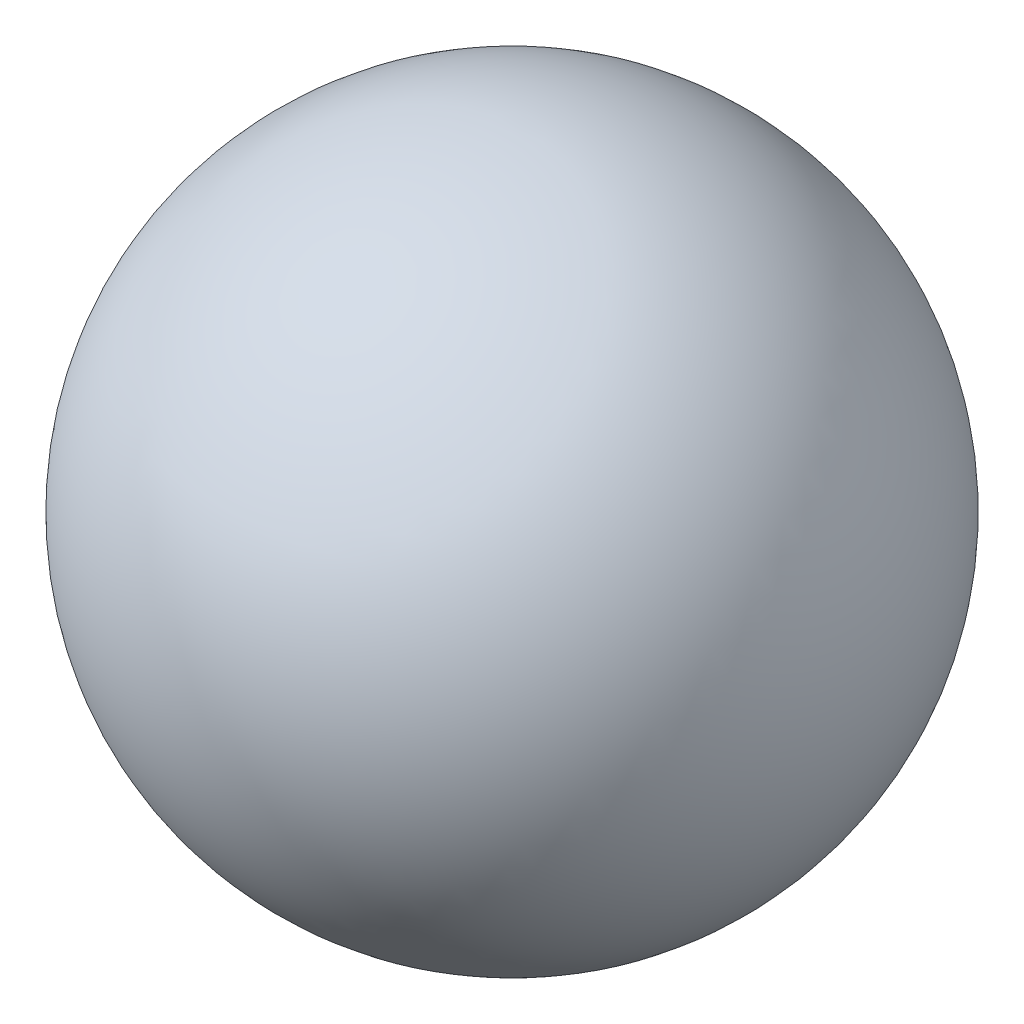
ISO-10303-21;
HEADER;
FILE_DESCRIPTION(('STEP AP214'),'2;1');
FILE_NAME('part.step','',(''),(''),'','','');
FILE_SCHEMA(('AUTOMOTIVE_DESIGN { 1 0 10303 214 1 1 1 1 }'));
ENDSEC;
DATA;
#1=APPLICATION_CONTEXT('core data for automotive mechanical design processes');
#2=APPLICATION_PROTOCOL_DEFINITION('international standard','automotive_design',2000,#1);
#3=PRODUCT_CONTEXT('',#1,'mechanical');
#4=PRODUCT('Part','Part','',(#3));
#5=PRODUCT_RELATED_PRODUCT_CATEGORY('part','',(#4));
#6=PRODUCT_DEFINITION_FORMATION('','',#4);
#7=PRODUCT_DEFINITION_CONTEXT('part definition',#1,'design');
#8=PRODUCT_DEFINITION('design','',#6,#7);
#9=PRODUCT_DEFINITION_SHAPE('','',#8);
#10=(LENGTH_UNIT() NAMED_UNIT(*) SI_UNIT(.MILLI.,.METRE.));
#11=(NAMED_UNIT(*) PLANE_ANGLE_UNIT() SI_UNIT($,.RADIAN.));
#12=(NAMED_UNIT(*) SI_UNIT($,.STERADIAN.) SOLID_ANGLE_UNIT());
#13=UNCERTAINTY_MEASURE_WITH_UNIT(LENGTH_MEASURE(1.E-05),#10,'distance_accuracy_value','');
#14=(GEOMETRIC_REPRESENTATION_CONTEXT(3) GLOBAL_UNCERTAINTY_ASSIGNED_CONTEXT((#13)) GLOBAL_UNIT_ASSIGNED_CONTEXT((#10,
#11,#12)) REPRESENTATION_CONTEXT('',''));
#15=CARTESIAN_POINT('',(0.,0.,0.));
#16=DIRECTION('',(0.,0.,1.));
#17=DIRECTION('',(1.,0.,0.));
#18=AXIS2_PLACEMENT_3D('',#15,#16,#17);
#19=CARTESIAN_POINT('',(0.,0.,0.));
#20=DIRECTION('',(0.,1.,0.));
#21=DIRECTION('',(-1.,0.,0.));
#22=AXIS2_PLACEMENT_3D('',#19,#20,#21);
#23=SPHERICAL_SURFACE('',#22,119.85625);
#24=CARTESIAN_POINT('',(0.,119.85625,0.));
#25=VERTEX_POINT('',#24);
#26=VERTEX_LOOP('',#25);
#27=FACE_BOUND('',#26,.T.);
#28=ADVANCED_FACE('F26',(#27),#23,.T.);
#29=CLOSED_SHELL('',(#28));
#30=MANIFOLD_SOLID_BREP('B2',#29);
#31=ADVANCED_BREP_SHAPE_REPRESENTATION('',(#18,#30),#14);
#32=SHAPE_DEFINITION_REPRESENTATION(#9,#31);
ENDSEC;
END-ISO-10303-21;
